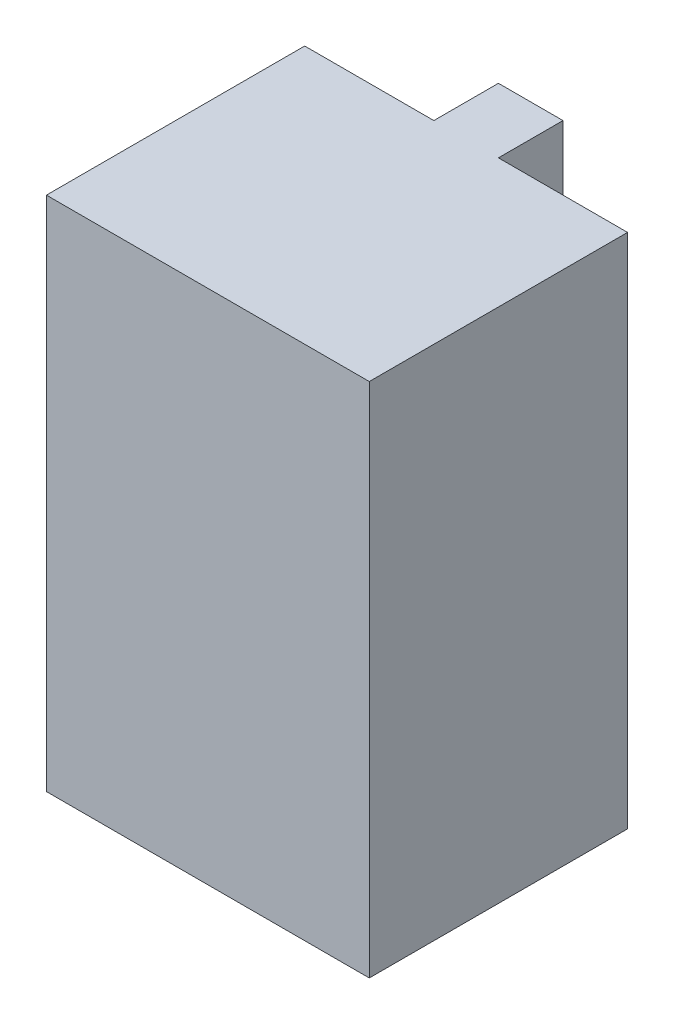
ISO-10303-21;
HEADER;
FILE_DESCRIPTION(('STEP AP214'),'2;1');
FILE_NAME('part.step','',(''),(''),'','','');
FILE_SCHEMA(('AUTOMOTIVE_DESIGN { 1 0 10303 214 1 1 1 1 }'));
ENDSEC;
DATA;
#1=APPLICATION_CONTEXT('core data for automotive mechanical design processes');
#2=APPLICATION_PROTOCOL_DEFINITION('international standard','automotive_design',2000,#1);
#3=PRODUCT_CONTEXT('',#1,'mechanical');
#4=PRODUCT('Part','Part','',(#3));
#5=PRODUCT_RELATED_PRODUCT_CATEGORY('part','',(#4));
#6=PRODUCT_DEFINITION_FORMATION('','',#4);
#7=PRODUCT_DEFINITION_CONTEXT('part definition',#1,'design');
#8=PRODUCT_DEFINITION('design','',#6,#7);
#9=PRODUCT_DEFINITION_SHAPE('','',#8);
#10=(LENGTH_UNIT() NAMED_UNIT(*) SI_UNIT(.MILLI.,.METRE.));
#11=(NAMED_UNIT(*) PLANE_ANGLE_UNIT() SI_UNIT($,.RADIAN.));
#12=(NAMED_UNIT(*) SI_UNIT($,.STERADIAN.) SOLID_ANGLE_UNIT());
#13=UNCERTAINTY_MEASURE_WITH_UNIT(LENGTH_MEASURE(1.E-05),#10,'distance_accuracy_value','');
#14=(GEOMETRIC_REPRESENTATION_CONTEXT(3) GLOBAL_UNCERTAINTY_ASSIGNED_CONTEXT((#13)) GLOBAL_UNIT_ASSIGNED_CONTEXT((#10,
#11,#12)) REPRESENTATION_CONTEXT('',''));
#15=CARTESIAN_POINT('',(0.,0.,0.));
#16=DIRECTION('',(0.,0.,1.));
#17=DIRECTION('',(1.,0.,0.));
#18=AXIS2_PLACEMENT_3D('',#15,#16,#17);
#19=CARTESIAN_POINT('',(0.,80.,0.));
#20=DIRECTION('',(1.,0.,0.));
#21=DIRECTION('',(0.,0.,-1.));
#22=AXIS2_PLACEMENT_3D('',#19,#20,#21);
#23=PLANE('',#22);
#24=DIRECTION('',(0.,0.,1.));
#25=VECTOR('',#24,1.);
#26=CARTESIAN_POINT('',(0.,0.,0.));
#27=LINE('',#26,#25);
#28=CARTESIAN_POINT('',(0.,0.,-40.));
#29=VERTEX_POINT('',#28);
#30=CARTESIAN_POINT('',(0.,0.,0.));
#31=VERTEX_POINT('',#30);
#32=EDGE_CURVE('E131',#29,#31,#27,.T.);
#33=ORIENTED_EDGE('',*,*,#32,.T.);
#34=DIRECTION('',(0.,-1.,0.));
#35=VECTOR('',#34,1.);
#36=CARTESIAN_POINT('',(0.,80.,0.));
#37=LINE('',#36,#35);
#38=CARTESIAN_POINT('',(0.,80.,0.));
#39=VERTEX_POINT('',#38);
#40=EDGE_CURVE('E11',#39,#31,#37,.T.);
#41=ORIENTED_EDGE('',*,*,#40,.F.);
#42=DIRECTION('',(0.,0.,1.));
#43=VECTOR('',#42,1.);
#44=CARTESIAN_POINT('',(0.,80.,0.));
#45=LINE('',#44,#43);
#46=CARTESIAN_POINT('',(0.,80.,-40.));
#47=VERTEX_POINT('',#46);
#48=EDGE_CURVE('E145',#47,#39,#45,.T.);
#49=ORIENTED_EDGE('',*,*,#48,.F.);
#50=DIRECTION('',(0.,-1.,0.));
#51=VECTOR('',#50,1.);
#52=CARTESIAN_POINT('',(0.,80.,-40.));
#53=LINE('',#52,#51);
#54=EDGE_CURVE('E127',#47,#29,#53,.T.);
#55=ORIENTED_EDGE('',*,*,#54,.T.);
#56=EDGE_LOOP('',(#33,#41,#49,#55));
#57=FACE_BOUND('',#56,.T.);
#58=ADVANCED_FACE('F35',(#57),#23,.F.);
#59=CARTESIAN_POINT('',(0.,80.,0.));
#60=DIRECTION('',(0.,0.,-1.));
#61=DIRECTION('',(-1.,0.,0.));
#62=AXIS2_PLACEMENT_3D('',#59,#60,#61);
#63=PLANE('',#62);
#64=DIRECTION('',(1.,0.,0.));
#65=VECTOR('',#64,1.);
#66=CARTESIAN_POINT('',(0.,0.,0.));
#67=LINE('',#66,#65);
#68=CARTESIAN_POINT('',(50.,0.,0.));
#69=VERTEX_POINT('',#68);
#70=EDGE_CURVE('E134',#31,#69,#67,.T.);
#71=ORIENTED_EDGE('',*,*,#70,.T.);
#72=DIRECTION('',(0.,-1.,0.));
#73=VECTOR('',#72,1.);
#74=CARTESIAN_POINT('',(50.,80.,0.));
#75=LINE('',#74,#73);
#76=CARTESIAN_POINT('',(50.,80.,0.));
#77=VERTEX_POINT('',#76);
#78=EDGE_CURVE('E43',#77,#69,#75,.T.);
#79=ORIENTED_EDGE('',*,*,#78,.F.);
#80=DIRECTION('',(1.,0.,0.));
#81=VECTOR('',#80,1.);
#82=CARTESIAN_POINT('',(0.,80.,0.));
#83=LINE('',#82,#81);
#84=EDGE_CURVE('E94',#39,#77,#83,.T.);
#85=ORIENTED_EDGE('',*,*,#84,.F.);
#86=ORIENTED_EDGE('',*,*,#40,.T.);
#87=EDGE_LOOP('',(#71,#79,#85,#86));
#88=FACE_BOUND('',#87,.T.);
#89=ADVANCED_FACE('F180',(#88),#63,.F.);
#90=CARTESIAN_POINT('',(50.,80.,0.));
#91=DIRECTION('',(-1.,0.,0.));
#92=DIRECTION('',(0.,0.,1.));
#93=AXIS2_PLACEMENT_3D('',#90,#91,#92);
#94=PLANE('',#93);
#95=DIRECTION('',(0.,0.,-1.));
#96=VECTOR('',#95,1.);
#97=CARTESIAN_POINT('',(50.,0.,0.));
#98=LINE('',#97,#96);
#99=CARTESIAN_POINT('',(50.,0.,-40.));
#100=VERTEX_POINT('',#99);
#101=EDGE_CURVE('E136',#69,#100,#98,.T.);
#102=ORIENTED_EDGE('',*,*,#101,.T.);
#103=DIRECTION('',(0.,-1.,0.));
#104=VECTOR('',#103,1.);
#105=CARTESIAN_POINT('',(50.,80.,-40.));
#106=LINE('',#105,#104);
#107=CARTESIAN_POINT('',(50.,80.,-40.));
#108=VERTEX_POINT('',#107);
#109=EDGE_CURVE('E152',#108,#100,#106,.T.);
#110=ORIENTED_EDGE('',*,*,#109,.F.);
#111=DIRECTION('',(0.,0.,-1.));
#112=VECTOR('',#111,1.);
#113=CARTESIAN_POINT('',(50.,80.,0.));
#114=LINE('',#113,#112);
#115=EDGE_CURVE('E160',#77,#108,#114,.T.);
#116=ORIENTED_EDGE('',*,*,#115,.F.);
#117=ORIENTED_EDGE('',*,*,#78,.T.);
#118=EDGE_LOOP('',(#102,#110,#116,#117));
#119=FACE_BOUND('',#118,.T.);
#120=ADVANCED_FACE('F158',(#119),#94,.F.);
#121=CARTESIAN_POINT('',(30.,80.,-40.));
#122=DIRECTION('',(0.,0.,1.));
#123=DIRECTION('',(1.,0.,0.));
#124=AXIS2_PLACEMENT_3D('',#121,#122,#123);
#125=PLANE('',#124);
#126=DIRECTION('',(-1.,0.,0.));
#127=VECTOR('',#126,1.);
#128=CARTESIAN_POINT('',(30.,0.,-40.));
#129=LINE('',#128,#127);
#130=CARTESIAN_POINT('',(30.,0.,-40.));
#131=VERTEX_POINT('',#130);
#132=EDGE_CURVE('E138',#100,#131,#129,.T.);
#133=ORIENTED_EDGE('',*,*,#132,.T.);
#134=DIRECTION('',(0.,-1.,0.));
#135=VECTOR('',#134,1.);
#136=CARTESIAN_POINT('',(30.,80.,-40.));
#137=LINE('',#136,#135);
#138=CARTESIAN_POINT('',(30.,80.,-40.));
#139=VERTEX_POINT('',#138);
#140=EDGE_CURVE('E149',#139,#131,#137,.T.);
#141=ORIENTED_EDGE('',*,*,#140,.F.);
#142=DIRECTION('',(-1.,0.,0.));
#143=VECTOR('',#142,1.);
#144=CARTESIAN_POINT('',(30.,80.,-40.));
#145=LINE('',#144,#143);
#146=EDGE_CURVE('E172',#108,#139,#145,.T.);
#147=ORIENTED_EDGE('',*,*,#146,.F.);
#148=ORIENTED_EDGE('',*,*,#109,.T.);
#149=EDGE_LOOP('',(#133,#141,#147,#148));
#150=FACE_BOUND('',#149,.T.);
#151=ADVANCED_FACE('F168',(#150),#125,.F.);
#152=CARTESIAN_POINT('',(30.,80.,-50.));
#153=DIRECTION('',(-1.,0.,0.));
#154=DIRECTION('',(0.,0.,1.));
#155=AXIS2_PLACEMENT_3D('',#152,#153,#154);
#156=PLANE('',#155);
#157=DIRECTION('',(0.,0.,-1.));
#158=VECTOR('',#157,1.);
#159=CARTESIAN_POINT('',(30.,0.,-50.));
#160=LINE('',#159,#158);
#161=CARTESIAN_POINT('',(30.,0.,-50.));
#162=VERTEX_POINT('',#161);
#163=EDGE_CURVE('E140',#131,#162,#160,.T.);
#164=ORIENTED_EDGE('',*,*,#163,.T.);
#165=DIRECTION('',(0.,-1.,0.));
#166=VECTOR('',#165,1.);
#167=CARTESIAN_POINT('',(30.,80.,-50.));
#168=LINE('',#167,#166);
#169=CARTESIAN_POINT('',(30.,80.,-50.));
#170=VERTEX_POINT('',#169);
#171=EDGE_CURVE('E122',#170,#162,#168,.T.);
#172=ORIENTED_EDGE('',*,*,#171,.F.);
#173=DIRECTION('',(0.,0.,-1.));
#174=VECTOR('',#173,1.);
#175=CARTESIAN_POINT('',(30.,80.,-50.));
#176=LINE('',#175,#174);
#177=EDGE_CURVE('E113',#139,#170,#176,.T.);
#178=ORIENTED_EDGE('',*,*,#177,.F.);
#179=ORIENTED_EDGE('',*,*,#140,.T.);
#180=EDGE_LOOP('',(#164,#172,#178,#179));
#181=FACE_BOUND('',#180,.T.);
#182=ADVANCED_FACE('F171',(#181),#156,.F.);
#183=CARTESIAN_POINT('',(20.,80.,-50.));
#184=DIRECTION('',(0.,0.,1.));
#185=DIRECTION('',(1.,0.,0.));
#186=AXIS2_PLACEMENT_3D('',#183,#184,#185);
#187=PLANE('',#186);
#188=DIRECTION('',(-1.,0.,0.));
#189=VECTOR('',#188,1.);
#190=CARTESIAN_POINT('',(20.,0.,-50.));
#191=LINE('',#190,#189);
#192=CARTESIAN_POINT('',(20.,0.,-50.));
#193=VERTEX_POINT('',#192);
#194=EDGE_CURVE('E121',#162,#193,#191,.T.);
#195=ORIENTED_EDGE('',*,*,#194,.T.);
#196=DIRECTION('',(0.,-1.,0.));
#197=VECTOR('',#196,1.);
#198=CARTESIAN_POINT('',(20.,80.,-50.));
#199=LINE('',#198,#197);
#200=CARTESIAN_POINT('',(20.,80.,-50.));
#201=VERTEX_POINT('',#200);
#202=EDGE_CURVE('E118',#201,#193,#199,.T.);
#203=ORIENTED_EDGE('',*,*,#202,.F.);
#204=DIRECTION('',(-1.,0.,0.));
#205=VECTOR('',#204,1.);
#206=CARTESIAN_POINT('',(20.,80.,-50.));
#207=LINE('',#206,#205);
#208=EDGE_CURVE('E107',#170,#201,#207,.T.);
#209=ORIENTED_EDGE('',*,*,#208,.F.);
#210=ORIENTED_EDGE('',*,*,#171,.T.);
#211=EDGE_LOOP('',(#195,#203,#209,#210));
#212=FACE_BOUND('',#211,.T.);
#213=ADVANCED_FACE('F119',(#212),#187,.F.);
#214=CARTESIAN_POINT('',(20.,80.,-40.));
#215=DIRECTION('',(1.,0.,0.));
#216=DIRECTION('',(0.,0.,-1.));
#217=AXIS2_PLACEMENT_3D('',#214,#215,#216);
#218=PLANE('',#217);
#219=DIRECTION('',(0.,0.,1.));
#220=VECTOR('',#219,1.);
#221=CARTESIAN_POINT('',(20.,0.,-40.));
#222=LINE('',#221,#220);
#223=CARTESIAN_POINT('',(20.,0.,-40.));
#224=VERTEX_POINT('',#223);
#225=EDGE_CURVE('E80',#193,#224,#222,.T.);
#226=ORIENTED_EDGE('',*,*,#225,.T.);
#227=DIRECTION('',(0.,-1.,0.));
#228=VECTOR('',#227,1.);
#229=CARTESIAN_POINT('',(20.,80.,-40.));
#230=LINE('',#229,#228);
#231=CARTESIAN_POINT('',(20.,80.,-40.));
#232=VERTEX_POINT('',#231);
#233=EDGE_CURVE('E123',#232,#224,#230,.T.);
#234=ORIENTED_EDGE('',*,*,#233,.F.);
#235=DIRECTION('',(0.,0.,1.));
#236=VECTOR('',#235,1.);
#237=CARTESIAN_POINT('',(20.,80.,-40.));
#238=LINE('',#237,#236);
#239=EDGE_CURVE('E111',#201,#232,#238,.T.);
#240=ORIENTED_EDGE('',*,*,#239,.F.);
#241=ORIENTED_EDGE('',*,*,#202,.T.);
#242=EDGE_LOOP('',(#226,#234,#240,#241));
#243=FACE_BOUND('',#242,.T.);
#244=ADVANCED_FACE('F125',(#243),#218,.F.);
#245=CARTESIAN_POINT('',(0.,80.,-40.));
#246=DIRECTION('',(0.,0.,1.));
#247=DIRECTION('',(1.,0.,0.));
#248=AXIS2_PLACEMENT_3D('',#245,#246,#247);
#249=PLANE('',#248);
#250=DIRECTION('',(-1.,0.,0.));
#251=VECTOR('',#250,1.);
#252=CARTESIAN_POINT('',(0.,0.,-40.));
#253=LINE('',#252,#251);
#254=EDGE_CURVE('E86',#224,#29,#253,.T.);
#255=ORIENTED_EDGE('',*,*,#254,.T.);
#256=ORIENTED_EDGE('',*,*,#54,.F.);
#257=DIRECTION('',(-1.,0.,0.));
#258=VECTOR('',#257,1.);
#259=CARTESIAN_POINT('',(0.,80.,-40.));
#260=LINE('',#259,#258);
#261=EDGE_CURVE('E51',#232,#47,#260,.T.);
#262=ORIENTED_EDGE('',*,*,#261,.F.);
#263=ORIENTED_EDGE('',*,*,#233,.T.);
#264=EDGE_LOOP('',(#255,#256,#262,#263));
#265=FACE_BOUND('',#264,.T.);
#266=ADVANCED_FACE('F196',(#265),#249,.F.);
#267=CARTESIAN_POINT('',(0.,80.,0.));
#268=DIRECTION('',(0.,-1.,0.));
#269=DIRECTION('',(0.,0.,-1.));
#270=AXIS2_PLACEMENT_3D('',#267,#268,#269);
#271=PLANE('',#270);
#272=ORIENTED_EDGE('',*,*,#48,.T.);
#273=ORIENTED_EDGE('',*,*,#84,.T.);
#274=ORIENTED_EDGE('',*,*,#115,.T.);
#275=ORIENTED_EDGE('',*,*,#146,.T.);
#276=ORIENTED_EDGE('',*,*,#177,.T.);
#277=ORIENTED_EDGE('',*,*,#208,.T.);
#278=ORIENTED_EDGE('',*,*,#239,.T.);
#279=ORIENTED_EDGE('',*,*,#261,.T.);
#280=EDGE_LOOP('',(#272,#273,#274,#275,#276,#277,#278,#279));
#281=FACE_BOUND('',#280,.T.);
#282=ADVANCED_FACE('F109',(#281),#271,.F.);
#283=CARTESIAN_POINT('',(0.,0.,0.));
#284=DIRECTION('',(0.,-1.,0.));
#285=DIRECTION('',(0.,0.,-1.));
#286=AXIS2_PLACEMENT_3D('',#283,#284,#285);
#287=PLANE('',#286);
#288=ORIENTED_EDGE('',*,*,#32,.F.);
#289=ORIENTED_EDGE('',*,*,#254,.F.);
#290=ORIENTED_EDGE('',*,*,#225,.F.);
#291=ORIENTED_EDGE('',*,*,#194,.F.);
#292=ORIENTED_EDGE('',*,*,#163,.F.);
#293=ORIENTED_EDGE('',*,*,#132,.F.);
#294=ORIENTED_EDGE('',*,*,#101,.F.);
#295=ORIENTED_EDGE('',*,*,#70,.F.);
#296=EDGE_LOOP('',(#288,#289,#290,#291,#292,#293,#294,#295));
#297=FACE_BOUND('',#296,.T.);
#298=ADVANCED_FACE('F164',(#297),#287,.T.);
#299=CLOSED_SHELL('',(#58,#89,#120,#151,#182,#213,#244,#266,#282,#298));
#300=MANIFOLD_SOLID_BREP('B2',#299);
#301=ADVANCED_BREP_SHAPE_REPRESENTATION('',(#18,#300),#14);
#302=SHAPE_DEFINITION_REPRESENTATION(#9,#301);
ENDSEC;
END-ISO-10303-21;
